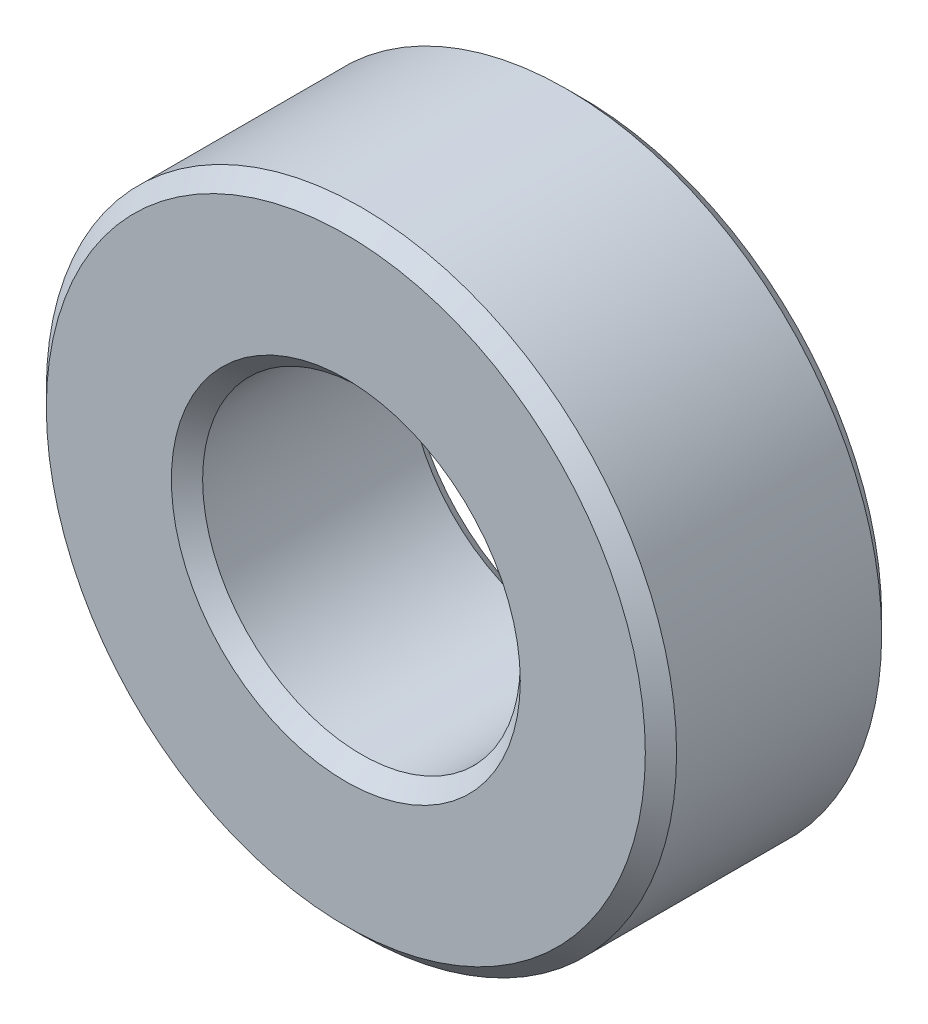
ISO-10303-21;
HEADER;
FILE_DESCRIPTION(('STEP AP214'),'2;1');
FILE_NAME('part.step','',(''),(''),'','','');
FILE_SCHEMA(('AUTOMOTIVE_DESIGN { 1 0 10303 214 1 1 1 1 }'));
ENDSEC;
DATA;
#1=APPLICATION_CONTEXT('core data for automotive mechanical design processes');
#2=APPLICATION_PROTOCOL_DEFINITION('international standard','automotive_design',2000,#1);
#3=PRODUCT_CONTEXT('',#1,'mechanical');
#4=PRODUCT('Part','Part','',(#3));
#5=PRODUCT_RELATED_PRODUCT_CATEGORY('part','',(#4));
#6=PRODUCT_DEFINITION_FORMATION('','',#4);
#7=PRODUCT_DEFINITION_CONTEXT('part definition',#1,'design');
#8=PRODUCT_DEFINITION('design','',#6,#7);
#9=PRODUCT_DEFINITION_SHAPE('','',#8);
#10=(LENGTH_UNIT() NAMED_UNIT(*) SI_UNIT(.MILLI.,.METRE.));
#11=(NAMED_UNIT(*) PLANE_ANGLE_UNIT() SI_UNIT($,.RADIAN.));
#12=(NAMED_UNIT(*) SI_UNIT($,.STERADIAN.) SOLID_ANGLE_UNIT());
#13=UNCERTAINTY_MEASURE_WITH_UNIT(LENGTH_MEASURE(1.E-05),#10,'distance_accuracy_value','');
#14=(GEOMETRIC_REPRESENTATION_CONTEXT(3) GLOBAL_UNCERTAINTY_ASSIGNED_CONTEXT((#13)) GLOBAL_UNIT_ASSIGNED_CONTEXT((#10,
#11,#12)) REPRESENTATION_CONTEXT('',''));
#15=CARTESIAN_POINT('',(0.,0.,0.));
#16=DIRECTION('',(0.,0.,1.));
#17=DIRECTION('',(1.,0.,0.));
#18=AXIS2_PLACEMENT_3D('',#15,#16,#17);
#19=CARTESIAN_POINT('',(0.,0.,-2.38125));
#20=DIRECTION('',(0.,0.,1.));
#21=DIRECTION('',(1.,0.,0.));
#22=AXIS2_PLACEMENT_3D('',#19,#20,#21);
#23=CYLINDRICAL_SURFACE('',#22,6.35);
#24=CARTESIAN_POINT('',(0.,0.,2.06629));
#25=DIRECTION('',(0.,0.,1.));
#26=DIRECTION('',(1.,0.,0.));
#27=AXIS2_PLACEMENT_3D('',#24,#25,#26);
#28=CIRCLE('',#27,6.35);
#29=CARTESIAN_POINT('',(6.35,0.,2.06629));
#30=VERTEX_POINT('',#29);
#31=EDGE_CURVE('E67',#30,#30,#28,.F.);
#32=ORIENTED_EDGE('',*,*,#31,.T.);
#33=EDGE_LOOP('',(#32));
#34=FACE_BOUND('',#33,.T.);
#35=CARTESIAN_POINT('',(0.,0.,-2.06629));
#36=DIRECTION('',(0.,0.,1.));
#37=DIRECTION('',(1.,0.,0.));
#38=AXIS2_PLACEMENT_3D('',#35,#36,#37);
#39=CIRCLE('',#38,6.35);
#40=CARTESIAN_POINT('',(6.35,0.,-2.06629));
#41=VERTEX_POINT('',#40);
#42=EDGE_CURVE('E71',#41,#41,#39,.T.);
#43=ORIENTED_EDGE('',*,*,#42,.T.);
#44=EDGE_LOOP('',(#43));
#45=FACE_BOUND('',#44,.T.);
#46=ADVANCED_FACE('F41',(#34,#45),#23,.T.);
#47=CARTESIAN_POINT('',(0.,0.,-2.38125));
#48=DIRECTION('',(0.,0.,1.));
#49=DIRECTION('',(1.,0.,0.));
#50=AXIS2_PLACEMENT_3D('',#47,#48,#49);
#51=PLANE('',#50);
#52=CARTESIAN_POINT('',(0.,0.,-2.38125));
#53=DIRECTION('',(0.,0.,1.));
#54=DIRECTION('',(1.,0.,0.));
#55=AXIS2_PLACEMENT_3D('',#52,#53,#54);
#56=CIRCLE('',#55,6.03504);
#57=CARTESIAN_POINT('',(6.03504,0.,-2.38125));
#58=VERTEX_POINT('',#57);
#59=EDGE_CURVE('E55',#58,#58,#56,.F.);
#60=ORIENTED_EDGE('',*,*,#59,.T.);
#61=EDGE_LOOP('',(#60));
#62=FACE_BOUND('',#61,.T.);
#63=CARTESIAN_POINT('',(0.,0.,-2.38125));
#64=DIRECTION('',(0.,0.,1.));
#65=DIRECTION('',(1.,0.,0.));
#66=AXIS2_PLACEMENT_3D('',#63,#64,#65);
#67=CIRCLE('',#66,3.51536);
#68=CARTESIAN_POINT('',(3.51536,0.,-2.38125));
#69=VERTEX_POINT('',#68);
#70=EDGE_CURVE('E61',#69,#69,#67,.T.);
#71=ORIENTED_EDGE('',*,*,#70,.T.);
#72=EDGE_LOOP('',(#71));
#73=FACE_BOUND('',#72,.T.);
#74=ADVANCED_FACE('F100',(#62,#73),#51,.F.);
#75=CARTESIAN_POINT('',(0.,0.,-2.38125));
#76=DIRECTION('',(0.,0.,1.));
#77=DIRECTION('',(1.,0.,0.));
#78=AXIS2_PLACEMENT_3D('',#75,#76,#77);
#79=CYLINDRICAL_SURFACE('',#78,3.2004);
#80=CARTESIAN_POINT('',(0.,0.,2.06629));
#81=DIRECTION('',(0.,0.,1.));
#82=DIRECTION('',(1.,0.,0.));
#83=AXIS2_PLACEMENT_3D('',#80,#81,#82);
#84=CIRCLE('',#83,3.2004);
#85=CARTESIAN_POINT('',(3.2004,0.,2.06629));
#86=VERTEX_POINT('',#85);
#87=EDGE_CURVE('E10',#86,#86,#84,.T.);
#88=ORIENTED_EDGE('',*,*,#87,.T.);
#89=EDGE_LOOP('',(#88));
#90=FACE_BOUND('',#89,.T.);
#91=CARTESIAN_POINT('',(0.,0.,-2.06629));
#92=DIRECTION('',(0.,0.,1.));
#93=DIRECTION('',(1.,0.,0.));
#94=AXIS2_PLACEMENT_3D('',#91,#92,#93);
#95=CIRCLE('',#94,3.2004);
#96=CARTESIAN_POINT('',(3.2004,0.,-2.06629));
#97=VERTEX_POINT('',#96);
#98=EDGE_CURVE('E49',#97,#97,#95,.F.);
#99=ORIENTED_EDGE('',*,*,#98,.T.);
#100=EDGE_LOOP('',(#99));
#101=FACE_BOUND('',#100,.T.);
#102=ADVANCED_FACE('F106',(#90,#101),#79,.F.);
#103=CARTESIAN_POINT('',(0.,0.,2.38125));
#104=DIRECTION('',(0.,0.,1.));
#105=DIRECTION('',(1.,0.,0.));
#106=AXIS2_PLACEMENT_3D('',#103,#104,#105);
#107=PLANE('',#106);
#108=CARTESIAN_POINT('',(0.,0.,2.38125));
#109=DIRECTION('',(0.,0.,1.));
#110=DIRECTION('',(1.,0.,0.));
#111=AXIS2_PLACEMENT_3D('',#108,#109,#110);
#112=CIRCLE('',#111,6.03504);
#113=CARTESIAN_POINT('',(6.03504,0.,2.38125));
#114=VERTEX_POINT('',#113);
#115=EDGE_CURVE('E75',#114,#114,#112,.T.);
#116=ORIENTED_EDGE('',*,*,#115,.T.);
#117=EDGE_LOOP('',(#116));
#118=FACE_BOUND('',#117,.T.);
#119=CARTESIAN_POINT('',(0.,0.,2.38125));
#120=DIRECTION('',(0.,0.,1.));
#121=DIRECTION('',(1.,0.,0.));
#122=AXIS2_PLACEMENT_3D('',#119,#120,#121);
#123=CIRCLE('',#122,3.51536);
#124=CARTESIAN_POINT('',(3.51536,0.,2.38125));
#125=VERTEX_POINT('',#124);
#126=EDGE_CURVE('E79',#125,#125,#123,.F.);
#127=ORIENTED_EDGE('',*,*,#126,.T.);
#128=EDGE_LOOP('',(#127));
#129=FACE_BOUND('',#128,.T.);
#130=ADVANCED_FACE('F85',(#118,#129),#107,.T.);
#131=CARTESIAN_POINT('',(0.,0.,2.38125));
#132=DIRECTION('',(0.,0.,-1.));
#133=DIRECTION('',(-1.,0.,0.));
#134=AXIS2_PLACEMENT_3D('',#131,#132,#133);
#135=CONICAL_SURFACE('',#134,6.03504,0.785398163397446);
#136=ORIENTED_EDGE('',*,*,#31,.F.);
#137=EDGE_LOOP('',(#136));
#138=FACE_BOUND('',#137,.T.);
#139=ORIENTED_EDGE('',*,*,#115,.F.);
#140=EDGE_LOOP('',(#139));
#141=FACE_BOUND('',#140,.T.);
#142=ADVANCED_FACE('F96',(#138,#141),#135,.T.);
#143=CARTESIAN_POINT('',(0.,0.,-2.06629));
#144=DIRECTION('',(0.,0.,1.));
#145=DIRECTION('',(1.,0.,0.));
#146=AXIS2_PLACEMENT_3D('',#143,#144,#145);
#147=CONICAL_SURFACE('',#146,6.35,0.785398163397454);
#148=ORIENTED_EDGE('',*,*,#59,.F.);
#149=EDGE_LOOP('',(#148));
#150=FACE_BOUND('',#149,.T.);
#151=ORIENTED_EDGE('',*,*,#42,.F.);
#152=EDGE_LOOP('',(#151));
#153=FACE_BOUND('',#152,.T.);
#154=ADVANCED_FACE('F90',(#150,#153),#147,.T.);
#155=CARTESIAN_POINT('',(0.,0.,2.06629));
#156=DIRECTION('',(0.,0.,1.));
#157=DIRECTION('',(1.,0.,0.));
#158=AXIS2_PLACEMENT_3D('',#155,#156,#157);
#159=CONICAL_SURFACE('',#158,3.2004,0.785398163397455);
#160=ORIENTED_EDGE('',*,*,#126,.F.);
#161=EDGE_LOOP('',(#160));
#162=FACE_BOUND('',#161,.T.);
#163=ORIENTED_EDGE('',*,*,#87,.F.);
#164=EDGE_LOOP('',(#163));
#165=FACE_BOUND('',#164,.T.);
#166=ADVANCED_FACE('F87',(#162,#165),#159,.F.);
#167=CARTESIAN_POINT('',(0.,0.,-2.38125));
#168=DIRECTION('',(0.,0.,-1.));
#169=DIRECTION('',(-1.,0.,0.));
#170=AXIS2_PLACEMENT_3D('',#167,#168,#169);
#171=CONICAL_SURFACE('',#170,3.51536,0.785398163397445);
#172=ORIENTED_EDGE('',*,*,#98,.F.);
#173=EDGE_LOOP('',(#172));
#174=FACE_BOUND('',#173,.T.);
#175=ORIENTED_EDGE('',*,*,#70,.F.);
#176=EDGE_LOOP('',(#175));
#177=FACE_BOUND('',#176,.T.);
#178=ADVANCED_FACE('F43',(#174,#177),#171,.F.);
#179=CLOSED_SHELL('',(#46,#74,#102,#130,#142,#154,#166,#178));
#180=MANIFOLD_SOLID_BREP('B2',#179);
#181=ADVANCED_BREP_SHAPE_REPRESENTATION('',(#18,#180),#14);
#182=SHAPE_DEFINITION_REPRESENTATION(#9,#181);
ENDSEC;
END-ISO-10303-21;
